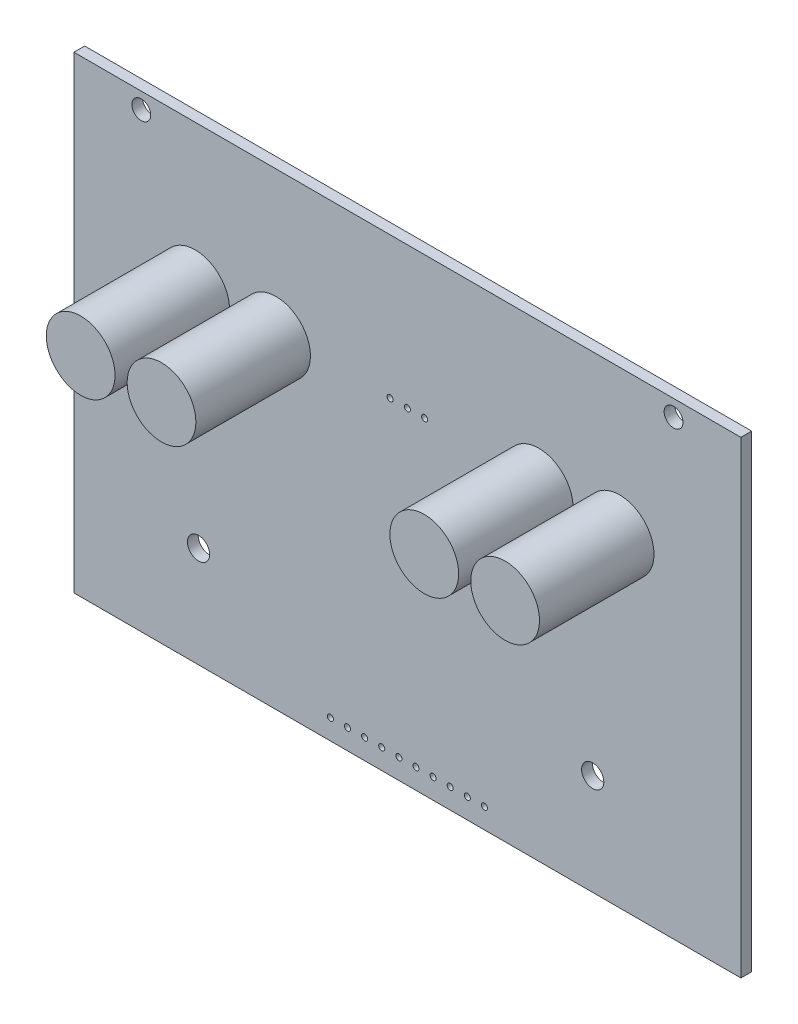
ISO-10303-21;
HEADER;
FILE_DESCRIPTION(('STEP AP214'),'2;1');
FILE_NAME('part.step','',(''),(''),'','','');
FILE_SCHEMA(('AUTOMOTIVE_DESIGN { 1 0 10303 214 1 1 1 1 }'));
ENDSEC;
DATA;
#1=APPLICATION_CONTEXT('core data for automotive mechanical design processes');
#2=APPLICATION_PROTOCOL_DEFINITION('international standard','automotive_design',2000,#1);
#3=PRODUCT_CONTEXT('',#1,'mechanical');
#4=PRODUCT('Part','Part','',(#3));
#5=PRODUCT_RELATED_PRODUCT_CATEGORY('part','',(#4));
#6=PRODUCT_DEFINITION_FORMATION('','',#4);
#7=PRODUCT_DEFINITION_CONTEXT('part definition',#1,'design');
#8=PRODUCT_DEFINITION('design','',#6,#7);
#9=PRODUCT_DEFINITION_SHAPE('','',#8);
#10=(LENGTH_UNIT() NAMED_UNIT(*) SI_UNIT(.MILLI.,.METRE.));
#11=(NAMED_UNIT(*) PLANE_ANGLE_UNIT() SI_UNIT($,.RADIAN.));
#12=(NAMED_UNIT(*) SI_UNIT($,.STERADIAN.) SOLID_ANGLE_UNIT());
#13=UNCERTAINTY_MEASURE_WITH_UNIT(LENGTH_MEASURE(1.E-05),#10,'distance_accuracy_value','');
#14=(GEOMETRIC_REPRESENTATION_CONTEXT(3) GLOBAL_UNCERTAINTY_ASSIGNED_CONTEXT((#13)) GLOBAL_UNIT_ASSIGNED_CONTEXT((#10,
#11,#12)) REPRESENTATION_CONTEXT('',''));
#15=CARTESIAN_POINT('',(0.,0.,0.));
#16=DIRECTION('',(0.,0.,1.));
#17=DIRECTION('',(1.,0.,0.));
#18=AXIS2_PLACEMENT_3D('',#15,#16,#17);
#19=CARTESIAN_POINT('',(0.,0.,1.6));
#20=DIRECTION('',(1.,0.,0.));
#21=DIRECTION('',(0.,1.,0.));
#22=AXIS2_PLACEMENT_3D('',#19,#20,#21);
#23=PLANE('',#22);
#24=DIRECTION('',(0.,-1.,0.));
#25=VECTOR('',#24,1.);
#26=CARTESIAN_POINT('',(0.,0.,0.));
#27=LINE('',#26,#25);
#28=CARTESIAN_POINT('',(0.,69.5,0.));
#29=VERTEX_POINT('',#28);
#30=CARTESIAN_POINT('',(0.,0.,0.));
#31=VERTEX_POINT('',#30);
#32=EDGE_CURVE('E103',#29,#31,#27,.T.);
#33=ORIENTED_EDGE('',*,*,#32,.T.);
#34=DIRECTION('',(0.,0.,-1.));
#35=VECTOR('',#34,1.);
#36=CARTESIAN_POINT('',(0.,0.,1.6));
#37=LINE('',#36,#35);
#38=CARTESIAN_POINT('',(0.,0.,1.6));
#39=VERTEX_POINT('',#38);
#40=EDGE_CURVE('E94',#39,#31,#37,.T.);
#41=ORIENTED_EDGE('',*,*,#40,.F.);
#42=DIRECTION('',(0.,-1.,0.));
#43=VECTOR('',#42,1.);
#44=CARTESIAN_POINT('',(0.,0.,1.6));
#45=LINE('',#44,#43);
#46=CARTESIAN_POINT('',(0.,69.5,1.6));
#47=VERTEX_POINT('',#46);
#48=EDGE_CURVE('E88',#47,#39,#45,.T.);
#49=ORIENTED_EDGE('',*,*,#48,.F.);
#50=DIRECTION('',(0.,0.,-1.));
#51=VECTOR('',#50,1.);
#52=CARTESIAN_POINT('',(0.,69.5,1.6));
#53=LINE('',#52,#51);
#54=EDGE_CURVE('E99',#47,#29,#53,.T.);
#55=ORIENTED_EDGE('',*,*,#54,.T.);
#56=EDGE_LOOP('',(#33,#41,#49,#55));
#57=FACE_BOUND('',#56,.T.);
#58=ADVANCED_FACE('F36',(#57),#23,.F.);
#59=CARTESIAN_POINT('',(0.,0.,1.6));
#60=DIRECTION('',(0.,1.,0.));
#61=DIRECTION('',(0.,0.,1.));
#62=AXIS2_PLACEMENT_3D('',#59,#60,#61);
#63=PLANE('',#62);
#64=DIRECTION('',(1.,0.,0.));
#65=VECTOR('',#64,1.);
#66=CARTESIAN_POINT('',(0.,0.,0.));
#67=LINE('',#66,#65);
#68=CARTESIAN_POINT('',(99.,0.,0.));
#69=VERTEX_POINT('',#68);
#70=EDGE_CURVE('E93',#31,#69,#67,.T.);
#71=ORIENTED_EDGE('',*,*,#70,.T.);
#72=DIRECTION('',(0.,0.,-1.));
#73=VECTOR('',#72,1.);
#74=CARTESIAN_POINT('',(99.,0.,1.6));
#75=LINE('',#74,#73);
#76=CARTESIAN_POINT('',(99.,0.,1.6));
#77=VERTEX_POINT('',#76);
#78=EDGE_CURVE('E91',#77,#69,#75,.T.);
#79=ORIENTED_EDGE('',*,*,#78,.F.);
#80=DIRECTION('',(1.,0.,0.));
#81=VECTOR('',#80,1.);
#82=CARTESIAN_POINT('',(0.,0.,1.6));
#83=LINE('',#82,#81);
#84=EDGE_CURVE('E83',#39,#77,#83,.T.);
#85=ORIENTED_EDGE('',*,*,#84,.F.);
#86=ORIENTED_EDGE('',*,*,#40,.T.);
#87=EDGE_LOOP('',(#71,#79,#85,#86));
#88=FACE_BOUND('',#87,.T.);
#89=ADVANCED_FACE('F92',(#88),#63,.F.);
#90=CARTESIAN_POINT('',(99.,0.,1.6));
#91=DIRECTION('',(-1.,0.,0.));
#92=DIRECTION('',(0.,-1.,0.));
#93=AXIS2_PLACEMENT_3D('',#90,#91,#92);
#94=PLANE('',#93);
#95=DIRECTION('',(0.,1.,0.));
#96=VECTOR('',#95,1.);
#97=CARTESIAN_POINT('',(99.,0.,0.));
#98=LINE('',#97,#96);
#99=CARTESIAN_POINT('',(99.,69.5,0.));
#100=VERTEX_POINT('',#99);
#101=EDGE_CURVE('E69',#69,#100,#98,.T.);
#102=ORIENTED_EDGE('',*,*,#101,.T.);
#103=DIRECTION('',(0.,0.,-1.));
#104=VECTOR('',#103,1.);
#105=CARTESIAN_POINT('',(99.,69.5,1.6));
#106=LINE('',#105,#104);
#107=CARTESIAN_POINT('',(99.,69.5,1.6));
#108=VERTEX_POINT('',#107);
#109=EDGE_CURVE('E95',#108,#100,#106,.T.);
#110=ORIENTED_EDGE('',*,*,#109,.F.);
#111=DIRECTION('',(0.,1.,0.));
#112=VECTOR('',#111,1.);
#113=CARTESIAN_POINT('',(99.,0.,1.6));
#114=LINE('',#113,#112);
#115=EDGE_CURVE('E86',#77,#108,#114,.T.);
#116=ORIENTED_EDGE('',*,*,#115,.F.);
#117=ORIENTED_EDGE('',*,*,#78,.T.);
#118=EDGE_LOOP('',(#102,#110,#116,#117));
#119=FACE_BOUND('',#118,.T.);
#120=ADVANCED_FACE('F97',(#119),#94,.F.);
#121=CARTESIAN_POINT('',(0.,69.5,1.6));
#122=DIRECTION('',(0.,-1.,0.));
#123=DIRECTION('',(0.,0.,-1.));
#124=AXIS2_PLACEMENT_3D('',#121,#122,#123);
#125=PLANE('',#124);
#126=DIRECTION('',(-1.,0.,0.));
#127=VECTOR('',#126,1.);
#128=CARTESIAN_POINT('',(0.,69.5,0.));
#129=LINE('',#128,#127);
#130=EDGE_CURVE('E75',#100,#29,#129,.T.);
#131=ORIENTED_EDGE('',*,*,#130,.T.);
#132=ORIENTED_EDGE('',*,*,#54,.F.);
#133=DIRECTION('',(-1.,0.,0.));
#134=VECTOR('',#133,1.);
#135=CARTESIAN_POINT('',(0.,69.5,1.6));
#136=LINE('',#135,#134);
#137=EDGE_CURVE('E52',#108,#47,#136,.T.);
#138=ORIENTED_EDGE('',*,*,#137,.F.);
#139=ORIENTED_EDGE('',*,*,#109,.T.);
#140=EDGE_LOOP('',(#131,#132,#138,#139));
#141=FACE_BOUND('',#140,.T.);
#142=ADVANCED_FACE('F126',(#141),#125,.F.);
#143=CARTESIAN_POINT('',(0.,0.,1.6));
#144=DIRECTION('',(0.,0.,-1.));
#145=DIRECTION('',(-1.,0.,0.));
#146=AXIS2_PLACEMENT_3D('',#143,#144,#145);
#147=PLANE('',#146);
#148=CARTESIAN_POINT('',(9.99999999999997,67.1,1.6));
#149=DIRECTION('',(0.,0.,-1.));
#150=DIRECTION('',(-1.,0.,0.));
#151=AXIS2_PLACEMENT_3D('',#148,#149,#150);
#152=CIRCLE('',#151,1.4);
#153=CARTESIAN_POINT('',(8.59999999999997,67.1,1.6));
#154=VERTEX_POINT('',#153);
#155=EDGE_CURVE('E435',#154,#154,#152,.T.);
#156=ORIENTED_EDGE('',*,*,#155,.T.);
#157=EDGE_LOOP('',(#156));
#158=FACE_BOUND('',#157,.T.);
#159=CARTESIAN_POINT('',(48.23,3.00000000000002,1.6));
#160=DIRECTION('',(0.,0.,-1.));
#161=DIRECTION('',(-1.,0.,0.));
#162=AXIS2_PLACEMENT_3D('',#159,#160,#161);
#163=CIRCLE('',#162,0.450000000000002);
#164=CARTESIAN_POINT('',(47.78,3.00000000000002,1.6));
#165=VERTEX_POINT('',#164);
#166=EDGE_CURVE('E437',#165,#165,#163,.T.);
#167=ORIENTED_EDGE('',*,*,#166,.T.);
#168=EDGE_LOOP('',(#167));
#169=FACE_BOUND('',#168,.T.);
#170=CARTESIAN_POINT('',(50.77,3.00000000000002,1.6));
#171=DIRECTION('',(0.,0.,-1.));
#172=DIRECTION('',(-1.,0.,0.));
#173=AXIS2_PLACEMENT_3D('',#170,#171,#172);
#174=CIRCLE('',#173,0.450000000000002);
#175=CARTESIAN_POINT('',(50.32,3.00000000000002,1.6));
#176=VERTEX_POINT('',#175);
#177=EDGE_CURVE('E443',#176,#176,#174,.T.);
#178=ORIENTED_EDGE('',*,*,#177,.T.);
#179=EDGE_LOOP('',(#178));
#180=FACE_BOUND('',#179,.T.);
#181=CARTESIAN_POINT('',(53.31,3.00000000000001,1.6));
#182=DIRECTION('',(0.,0.,-1.));
#183=DIRECTION('',(-1.,0.,0.));
#184=AXIS2_PLACEMENT_3D('',#181,#182,#183);
#185=CIRCLE('',#184,0.450000000000002);
#186=CARTESIAN_POINT('',(52.86,3.00000000000001,1.6));
#187=VERTEX_POINT('',#186);
#188=EDGE_CURVE('E458',#187,#187,#185,.T.);
#189=ORIENTED_EDGE('',*,*,#188,.T.);
#190=EDGE_LOOP('',(#189));
#191=FACE_BOUND('',#190,.T.);
#192=CARTESIAN_POINT('',(55.85,3.00000000000001,1.6));
#193=DIRECTION('',(0.,0.,-1.));
#194=DIRECTION('',(-1.,0.,0.));
#195=AXIS2_PLACEMENT_3D('',#192,#193,#194);
#196=CIRCLE('',#195,0.450000000000002);
#197=CARTESIAN_POINT('',(55.4,3.00000000000001,1.6));
#198=VERTEX_POINT('',#197);
#199=EDGE_CURVE('E461',#198,#198,#196,.T.);
#200=ORIENTED_EDGE('',*,*,#199,.T.);
#201=EDGE_LOOP('',(#200));
#202=FACE_BOUND('',#201,.T.);
#203=CARTESIAN_POINT('',(58.39,3.00000000000001,1.6));
#204=DIRECTION('',(0.,0.,-1.));
#205=DIRECTION('',(-1.,0.,0.));
#206=AXIS2_PLACEMENT_3D('',#203,#204,#205);
#207=CIRCLE('',#206,0.450000000000002);
#208=CARTESIAN_POINT('',(57.94,3.00000000000001,1.6));
#209=VERTEX_POINT('',#208);
#210=EDGE_CURVE('E464',#209,#209,#207,.T.);
#211=ORIENTED_EDGE('',*,*,#210,.T.);
#212=EDGE_LOOP('',(#211));
#213=FACE_BOUND('',#212,.T.);
#214=CARTESIAN_POINT('',(60.93,3.00000000000001,1.6));
#215=DIRECTION('',(0.,0.,-1.));
#216=DIRECTION('',(-1.,0.,0.));
#217=AXIS2_PLACEMENT_3D('',#214,#215,#216);
#218=CIRCLE('',#217,0.450000000000002);
#219=CARTESIAN_POINT('',(60.48,3.00000000000001,1.6));
#220=VERTEX_POINT('',#219);
#221=EDGE_CURVE('E467',#220,#220,#218,.T.);
#222=ORIENTED_EDGE('',*,*,#221,.T.);
#223=EDGE_LOOP('',(#222));
#224=FACE_BOUND('',#223,.T.);
#225=CARTESIAN_POINT('',(40.61,3.00000000000001,1.6));
#226=DIRECTION('',(0.,0.,-1.));
#227=DIRECTION('',(-1.,0.,0.));
#228=AXIS2_PLACEMENT_3D('',#225,#226,#227);
#229=CIRCLE('',#228,0.450000000000002);
#230=CARTESIAN_POINT('',(40.16,3.00000000000001,1.6));
#231=VERTEX_POINT('',#230);
#232=EDGE_CURVE('E470',#231,#231,#229,.T.);
#233=ORIENTED_EDGE('',*,*,#232,.T.);
#234=EDGE_LOOP('',(#233));
#235=FACE_BOUND('',#234,.T.);
#236=CARTESIAN_POINT('',(38.07,3.00000000000001,1.6));
#237=DIRECTION('',(0.,0.,-1.));
#238=DIRECTION('',(-1.,0.,0.));
#239=AXIS2_PLACEMENT_3D('',#236,#237,#238);
#240=CIRCLE('',#239,0.450000000000002);
#241=CARTESIAN_POINT('',(37.62,3.00000000000001,1.6));
#242=VERTEX_POINT('',#241);
#243=EDGE_CURVE('E473',#242,#242,#240,.T.);
#244=ORIENTED_EDGE('',*,*,#243,.T.);
#245=EDGE_LOOP('',(#244));
#246=FACE_BOUND('',#245,.T.);
#247=CARTESIAN_POINT('',(49.5,48.5,1.6));
#248=DIRECTION('',(0.,0.,-1.));
#249=DIRECTION('',(-1.,0.,0.));
#250=AXIS2_PLACEMENT_3D('',#247,#248,#249);
#251=CIRCLE('',#250,0.450000000000002);
#252=CARTESIAN_POINT('',(49.05,48.5,1.6));
#253=VERTEX_POINT('',#252);
#254=EDGE_CURVE('E476',#253,#253,#251,.T.);
#255=ORIENTED_EDGE('',*,*,#254,.T.);
#256=EDGE_LOOP('',(#255));
#257=FACE_BOUND('',#256,.T.);
#258=CARTESIAN_POINT('',(77.,15.,1.6));
#259=DIRECTION('',(0.,0.,-1.));
#260=DIRECTION('',(-1.,0.,0.));
#261=AXIS2_PLACEMENT_3D('',#258,#259,#260);
#262=CIRCLE('',#261,1.65);
#263=CARTESIAN_POINT('',(75.35,15.,1.6));
#264=VERTEX_POINT('',#263);
#265=EDGE_CURVE('E479',#264,#264,#262,.T.);
#266=ORIENTED_EDGE('',*,*,#265,.T.);
#267=EDGE_LOOP('',(#266));
#268=FACE_BOUND('',#267,.T.);
#269=CARTESIAN_POINT('',(18.5,15.,1.6));
#270=DIRECTION('',(0.,0.,-1.));
#271=DIRECTION('',(-1.,0.,0.));
#272=AXIS2_PLACEMENT_3D('',#269,#270,#271);
#273=CIRCLE('',#272,1.65);
#274=CARTESIAN_POINT('',(16.85,15.,1.6));
#275=VERTEX_POINT('',#274);
#276=EDGE_CURVE('E482',#275,#275,#273,.T.);
#277=ORIENTED_EDGE('',*,*,#276,.T.);
#278=EDGE_LOOP('',(#277));
#279=FACE_BOUND('',#278,.T.);
#280=CARTESIAN_POINT('',(89.,67.1,1.6));
#281=DIRECTION('',(0.,0.,-1.));
#282=DIRECTION('',(-1.,0.,0.));
#283=AXIS2_PLACEMENT_3D('',#280,#281,#282);
#284=CIRCLE('',#283,1.4);
#285=CARTESIAN_POINT('',(87.6,67.1,1.6));
#286=VERTEX_POINT('',#285);
#287=EDGE_CURVE('E485',#286,#286,#284,.T.);
#288=ORIENTED_EDGE('',*,*,#287,.T.);
#289=EDGE_LOOP('',(#288));
#290=FACE_BOUND('',#289,.T.);
#291=CARTESIAN_POINT('',(52.06,48.5,1.6));
#292=DIRECTION('',(0.,0.,-1.));
#293=DIRECTION('',(-1.,0.,0.));
#294=AXIS2_PLACEMENT_3D('',#291,#292,#293);
#295=CIRCLE('',#294,0.450000000000002);
#296=CARTESIAN_POINT('',(51.61,48.5,1.6));
#297=VERTEX_POINT('',#296);
#298=EDGE_CURVE('E488',#297,#297,#295,.T.);
#299=ORIENTED_EDGE('',*,*,#298,.T.);
#300=EDGE_LOOP('',(#299));
#301=FACE_BOUND('',#300,.T.);
#302=CARTESIAN_POINT('',(46.94,48.5,1.6));
#303=DIRECTION('',(0.,0.,-1.));
#304=DIRECTION('',(-1.,0.,0.));
#305=AXIS2_PLACEMENT_3D('',#302,#303,#304);
#306=CIRCLE('',#305,0.450000000000002);
#307=CARTESIAN_POINT('',(46.49,48.5,1.6));
#308=VERTEX_POINT('',#307);
#309=EDGE_CURVE('E491',#308,#308,#306,.T.);
#310=ORIENTED_EDGE('',*,*,#309,.T.);
#311=EDGE_LOOP('',(#310));
#312=FACE_BOUND('',#311,.T.);
#313=CARTESIAN_POINT('',(43.15,3.00000000000001,1.6));
#314=DIRECTION('',(0.,0.,-1.));
#315=DIRECTION('',(-1.,0.,0.));
#316=AXIS2_PLACEMENT_3D('',#313,#314,#315);
#317=CIRCLE('',#316,0.450000000000002);
#318=CARTESIAN_POINT('',(42.7,3.00000000000001,1.6));
#319=VERTEX_POINT('',#318);
#320=EDGE_CURVE('E494',#319,#319,#317,.T.);
#321=ORIENTED_EDGE('',*,*,#320,.T.);
#322=EDGE_LOOP('',(#321));
#323=FACE_BOUND('',#322,.T.);
#324=CARTESIAN_POINT('',(45.69,3.00000000000001,1.6));
#325=DIRECTION('',(0.,0.,-1.));
#326=DIRECTION('',(-1.,0.,0.));
#327=AXIS2_PLACEMENT_3D('',#324,#325,#326);
#328=CIRCLE('',#327,0.450000000000002);
#329=CARTESIAN_POINT('',(45.24,3.00000000000001,1.6));
#330=VERTEX_POINT('',#329);
#331=EDGE_CURVE('E497',#330,#330,#328,.T.);
#332=ORIENTED_EDGE('',*,*,#331,.T.);
#333=EDGE_LOOP('',(#332));
#334=FACE_BOUND('',#333,.T.);
#335=CARTESIAN_POINT('',(81.,48.,1.6));
#336=DIRECTION('',(0.,0.,-1.));
#337=DIRECTION('',(-1.,0.,0.));
#338=AXIS2_PLACEMENT_3D('',#335,#336,#337);
#339=CIRCLE('',#338,5.1);
#340=CARTESIAN_POINT('',(75.9,48.,1.6));
#341=VERTEX_POINT('',#340);
#342=EDGE_CURVE('E11',#341,#341,#339,.F.);
#343=ORIENTED_EDGE('',*,*,#342,.F.);
#344=EDGE_LOOP('',(#343));
#345=FACE_BOUND('',#344,.T.);
#346=CARTESIAN_POINT('',(69.,48.,1.6));
#347=DIRECTION('',(0.,0.,-1.));
#348=DIRECTION('',(-1.,0.,0.));
#349=AXIS2_PLACEMENT_3D('',#346,#347,#348);
#350=CIRCLE('',#349,5.1);
#351=CARTESIAN_POINT('',(63.9,48.,1.6));
#352=VERTEX_POINT('',#351);
#353=EDGE_CURVE('E44',#352,#352,#350,.F.);
#354=ORIENTED_EDGE('',*,*,#353,.F.);
#355=EDGE_LOOP('',(#354));
#356=FACE_BOUND('',#355,.T.);
#357=CARTESIAN_POINT('',(30.,48.,1.6));
#358=DIRECTION('',(0.,0.,-1.));
#359=DIRECTION('',(-1.,0.,0.));
#360=AXIS2_PLACEMENT_3D('',#357,#358,#359);
#361=CIRCLE('',#360,5.1);
#362=CARTESIAN_POINT('',(24.9,48.,1.6));
#363=VERTEX_POINT('',#362);
#364=EDGE_CURVE('E116',#363,#363,#361,.F.);
#365=ORIENTED_EDGE('',*,*,#364,.F.);
#366=EDGE_LOOP('',(#365));
#367=FACE_BOUND('',#366,.T.);
#368=CARTESIAN_POINT('',(18.,48.,1.6));
#369=DIRECTION('',(0.,0.,-1.));
#370=DIRECTION('',(-1.,0.,0.));
#371=AXIS2_PLACEMENT_3D('',#368,#369,#370);
#372=CIRCLE('',#371,5.1);
#373=CARTESIAN_POINT('',(12.9,48.,1.6));
#374=VERTEX_POINT('',#373);
#375=EDGE_CURVE('E113',#374,#374,#372,.F.);
#376=ORIENTED_EDGE('',*,*,#375,.F.);
#377=EDGE_LOOP('',(#376));
#378=FACE_BOUND('',#377,.T.);
#379=ORIENTED_EDGE('',*,*,#48,.T.);
#380=ORIENTED_EDGE('',*,*,#84,.T.);
#381=ORIENTED_EDGE('',*,*,#115,.T.);
#382=ORIENTED_EDGE('',*,*,#137,.T.);
#383=EDGE_LOOP('',(#379,#380,#381,#382));
#384=FACE_BOUND('',#383,.T.);
#385=ADVANCED_FACE('F84',(#158,#169,#180,#191,#202,#213,#224,#235,#246,#257,#268,#279,#290,#301,
#312,#323,#334,#345,#356,#367,#378,#384),#147,.F.);
#386=CARTESIAN_POINT('',(0.,0.,0.));
#387=DIRECTION('',(0.,0.,-1.));
#388=DIRECTION('',(-1.,0.,0.));
#389=AXIS2_PLACEMENT_3D('',#386,#387,#388);
#390=PLANE('',#389);
#391=CARTESIAN_POINT('',(9.99999999999997,67.1,0.));
#392=DIRECTION('',(0.,0.,1.));
#393=DIRECTION('',(1.,0.,0.));
#394=AXIS2_PLACEMENT_3D('',#391,#392,#393);
#395=CIRCLE('',#394,1.4);
#396=CARTESIAN_POINT('',(11.4,67.1,0.));
#397=VERTEX_POINT('',#396);
#398=EDGE_CURVE('E432',#397,#397,#395,.T.);
#399=ORIENTED_EDGE('',*,*,#398,.T.);
#400=EDGE_LOOP('',(#399));
#401=FACE_BOUND('',#400,.T.);
#402=CARTESIAN_POINT('',(48.23,3.00000000000002,0.));
#403=DIRECTION('',(0.,0.,1.));
#404=DIRECTION('',(1.,0.,0.));
#405=AXIS2_PLACEMENT_3D('',#402,#403,#404);
#406=CIRCLE('',#405,0.450000000000002);
#407=CARTESIAN_POINT('',(48.68,3.00000000000002,0.));
#408=VERTEX_POINT('',#407);
#409=EDGE_CURVE('E517',#408,#408,#406,.T.);
#410=ORIENTED_EDGE('',*,*,#409,.T.);
#411=EDGE_LOOP('',(#410));
#412=FACE_BOUND('',#411,.T.);
#413=CARTESIAN_POINT('',(50.77,3.00000000000002,0.));
#414=DIRECTION('',(0.,0.,1.));
#415=DIRECTION('',(1.,0.,0.));
#416=AXIS2_PLACEMENT_3D('',#413,#414,#415);
#417=CIRCLE('',#416,0.450000000000002);
#418=CARTESIAN_POINT('',(51.22,3.00000000000002,0.));
#419=VERTEX_POINT('',#418);
#420=EDGE_CURVE('E532',#419,#419,#417,.T.);
#421=ORIENTED_EDGE('',*,*,#420,.T.);
#422=EDGE_LOOP('',(#421));
#423=FACE_BOUND('',#422,.T.);
#424=CARTESIAN_POINT('',(53.31,3.00000000000001,0.));
#425=DIRECTION('',(0.,0.,1.));
#426=DIRECTION('',(1.,0.,0.));
#427=AXIS2_PLACEMENT_3D('',#424,#425,#426);
#428=CIRCLE('',#427,0.450000000000002);
#429=CARTESIAN_POINT('',(53.76,3.00000000000001,0.));
#430=VERTEX_POINT('',#429);
#431=EDGE_CURVE('E528',#430,#430,#428,.T.);
#432=ORIENTED_EDGE('',*,*,#431,.T.);
#433=EDGE_LOOP('',(#432));
#434=FACE_BOUND('',#433,.T.);
#435=CARTESIAN_POINT('',(55.85,3.00000000000001,0.));
#436=DIRECTION('',(0.,0.,1.));
#437=DIRECTION('',(1.,0.,0.));
#438=AXIS2_PLACEMENT_3D('',#435,#436,#437);
#439=CIRCLE('',#438,0.450000000000002);
#440=CARTESIAN_POINT('',(56.3,3.00000000000001,0.));
#441=VERTEX_POINT('',#440);
#442=EDGE_CURVE('E525',#441,#441,#439,.T.);
#443=ORIENTED_EDGE('',*,*,#442,.T.);
#444=EDGE_LOOP('',(#443));
#445=FACE_BOUND('',#444,.T.);
#446=CARTESIAN_POINT('',(58.39,3.00000000000001,0.));
#447=DIRECTION('',(0.,0.,1.));
#448=DIRECTION('',(1.,0.,0.));
#449=AXIS2_PLACEMENT_3D('',#446,#447,#448);
#450=CIRCLE('',#449,0.450000000000002);
#451=CARTESIAN_POINT('',(58.84,3.00000000000001,0.));
#452=VERTEX_POINT('',#451);
#453=EDGE_CURVE('E529',#452,#452,#450,.T.);
#454=ORIENTED_EDGE('',*,*,#453,.T.);
#455=EDGE_LOOP('',(#454));
#456=FACE_BOUND('',#455,.T.);
#457=CARTESIAN_POINT('',(60.93,3.00000000000001,0.));
#458=DIRECTION('',(0.,0.,1.));
#459=DIRECTION('',(1.,0.,0.));
#460=AXIS2_PLACEMENT_3D('',#457,#458,#459);
#461=CIRCLE('',#460,0.450000000000002);
#462=CARTESIAN_POINT('',(61.38,3.00000000000001,0.));
#463=VERTEX_POINT('',#462);
#464=EDGE_CURVE('E543',#463,#463,#461,.T.);
#465=ORIENTED_EDGE('',*,*,#464,.T.);
#466=EDGE_LOOP('',(#465));
#467=FACE_BOUND('',#466,.T.);
#468=CARTESIAN_POINT('',(40.61,3.00000000000001,0.));
#469=DIRECTION('',(0.,0.,1.));
#470=DIRECTION('',(1.,0.,0.));
#471=AXIS2_PLACEMENT_3D('',#468,#469,#470);
#472=CIRCLE('',#471,0.450000000000002);
#473=CARTESIAN_POINT('',(41.06,3.00000000000001,0.));
#474=VERTEX_POINT('',#473);
#475=EDGE_CURVE('E540',#474,#474,#472,.T.);
#476=ORIENTED_EDGE('',*,*,#475,.T.);
#477=EDGE_LOOP('',(#476));
#478=FACE_BOUND('',#477,.T.);
#479=CARTESIAN_POINT('',(38.07,3.00000000000001,0.));
#480=DIRECTION('',(0.,0.,1.));
#481=DIRECTION('',(1.,0.,0.));
#482=AXIS2_PLACEMENT_3D('',#479,#480,#481);
#483=CIRCLE('',#482,0.450000000000002);
#484=CARTESIAN_POINT('',(38.52,3.00000000000001,0.));
#485=VERTEX_POINT('',#484);
#486=EDGE_CURVE('E537',#485,#485,#483,.T.);
#487=ORIENTED_EDGE('',*,*,#486,.T.);
#488=EDGE_LOOP('',(#487));
#489=FACE_BOUND('',#488,.T.);
#490=CARTESIAN_POINT('',(49.5,48.5,0.));
#491=DIRECTION('',(0.,0.,1.));
#492=DIRECTION('',(1.,0.,0.));
#493=AXIS2_PLACEMENT_3D('',#490,#491,#492);
#494=CIRCLE('',#493,0.450000000000002);
#495=CARTESIAN_POINT('',(49.95,48.5,0.));
#496=VERTEX_POINT('',#495);
#497=EDGE_CURVE('E507',#496,#496,#494,.T.);
#498=ORIENTED_EDGE('',*,*,#497,.T.);
#499=EDGE_LOOP('',(#498));
#500=FACE_BOUND('',#499,.T.);
#501=CARTESIAN_POINT('',(77.,15.,0.));
#502=DIRECTION('',(0.,0.,1.));
#503=DIRECTION('',(1.,0.,0.));
#504=AXIS2_PLACEMENT_3D('',#501,#502,#503);
#505=CIRCLE('',#504,1.65);
#506=CARTESIAN_POINT('',(78.65,15.,0.));
#507=VERTEX_POINT('',#506);
#508=EDGE_CURVE('E504',#507,#507,#505,.T.);
#509=ORIENTED_EDGE('',*,*,#508,.T.);
#510=EDGE_LOOP('',(#509));
#511=FACE_BOUND('',#510,.T.);
#512=CARTESIAN_POINT('',(18.5,15.,0.));
#513=DIRECTION('',(0.,0.,1.));
#514=DIRECTION('',(1.,0.,0.));
#515=AXIS2_PLACEMENT_3D('',#512,#513,#514);
#516=CIRCLE('',#515,1.65);
#517=CARTESIAN_POINT('',(20.15,15.,0.));
#518=VERTEX_POINT('',#517);
#519=EDGE_CURVE('E500',#518,#518,#516,.T.);
#520=ORIENTED_EDGE('',*,*,#519,.T.);
#521=EDGE_LOOP('',(#520));
#522=FACE_BOUND('',#521,.T.);
#523=CARTESIAN_POINT('',(89.,67.1,0.));
#524=DIRECTION('',(0.,0.,1.));
#525=DIRECTION('',(1.,0.,0.));
#526=AXIS2_PLACEMENT_3D('',#523,#524,#525);
#527=CIRCLE('',#526,1.4);
#528=CARTESIAN_POINT('',(90.4,67.1,0.));
#529=VERTEX_POINT('',#528);
#530=EDGE_CURVE('E503',#529,#529,#527,.T.);
#531=ORIENTED_EDGE('',*,*,#530,.T.);
#532=EDGE_LOOP('',(#531));
#533=FACE_BOUND('',#532,.T.);
#534=CARTESIAN_POINT('',(52.06,48.5,0.));
#535=DIRECTION('',(0.,0.,1.));
#536=DIRECTION('',(1.,0.,0.));
#537=AXIS2_PLACEMENT_3D('',#534,#535,#536);
#538=CIRCLE('',#537,0.450000000000002);
#539=CARTESIAN_POINT('',(52.51,48.5,0.));
#540=VERTEX_POINT('',#539);
#541=EDGE_CURVE('E510',#540,#540,#538,.T.);
#542=ORIENTED_EDGE('',*,*,#541,.T.);
#543=EDGE_LOOP('',(#542));
#544=FACE_BOUND('',#543,.T.);
#545=CARTESIAN_POINT('',(46.94,48.5,0.));
#546=DIRECTION('',(0.,0.,1.));
#547=DIRECTION('',(1.,0.,0.));
#548=AXIS2_PLACEMENT_3D('',#545,#546,#547);
#549=CIRCLE('',#548,0.450000000000002);
#550=CARTESIAN_POINT('',(47.39,48.5,0.));
#551=VERTEX_POINT('',#550);
#552=EDGE_CURVE('E520',#551,#551,#549,.T.);
#553=ORIENTED_EDGE('',*,*,#552,.T.);
#554=EDGE_LOOP('',(#553));
#555=FACE_BOUND('',#554,.T.);
#556=CARTESIAN_POINT('',(43.15,3.00000000000001,0.));
#557=DIRECTION('',(0.,0.,1.));
#558=DIRECTION('',(1.,0.,0.));
#559=AXIS2_PLACEMENT_3D('',#556,#557,#558);
#560=CIRCLE('',#559,0.450000000000002);
#561=CARTESIAN_POINT('',(43.6,3.00000000000001,0.));
#562=VERTEX_POINT('',#561);
#563=EDGE_CURVE('E516',#562,#562,#560,.T.);
#564=ORIENTED_EDGE('',*,*,#563,.T.);
#565=EDGE_LOOP('',(#564));
#566=FACE_BOUND('',#565,.T.);
#567=CARTESIAN_POINT('',(45.69,3.00000000000001,0.));
#568=DIRECTION('',(0.,0.,1.));
#569=DIRECTION('',(1.,0.,0.));
#570=AXIS2_PLACEMENT_3D('',#567,#568,#569);
#571=CIRCLE('',#570,0.450000000000002);
#572=CARTESIAN_POINT('',(46.14,3.00000000000001,0.));
#573=VERTEX_POINT('',#572);
#574=EDGE_CURVE('E513',#573,#573,#571,.T.);
#575=ORIENTED_EDGE('',*,*,#574,.T.);
#576=EDGE_LOOP('',(#575));
#577=FACE_BOUND('',#576,.T.);
#578=ORIENTED_EDGE('',*,*,#32,.F.);
#579=ORIENTED_EDGE('',*,*,#130,.F.);
#580=ORIENTED_EDGE('',*,*,#101,.F.);
#581=ORIENTED_EDGE('',*,*,#70,.F.);
#582=EDGE_LOOP('',(#578,#579,#580,#581));
#583=FACE_BOUND('',#582,.T.);
#584=ADVANCED_FACE('F125',(#401,#412,#423,#434,#445,#456,#467,#478,#489,#500,#511,#522,#533,
#544,#555,#566,#577,#583),#390,.T.);
#585=CARTESIAN_POINT('',(18.,48.,18.6));
#586=DIRECTION('',(0.,0.,-1.));
#587=DIRECTION('',(-1.,0.,0.));
#588=AXIS2_PLACEMENT_3D('',#585,#586,#587);
#589=CYLINDRICAL_SURFACE('',#588,5.1);
#590=CARTESIAN_POINT('',(18.,48.,18.6));
#591=DIRECTION('',(0.,0.,1.));
#592=DIRECTION('',(1.,0.,0.));
#593=AXIS2_PLACEMENT_3D('',#590,#591,#592);
#594=CIRCLE('',#593,5.1);
#595=CARTESIAN_POINT('',(23.1,48.,18.6));
#596=VERTEX_POINT('',#595);
#597=EDGE_CURVE('E106',#596,#596,#594,.T.);
#598=ORIENTED_EDGE('',*,*,#597,.F.);
#599=EDGE_LOOP('',(#598));
#600=FACE_BOUND('',#599,.T.);
#601=ORIENTED_EDGE('',*,*,#375,.T.);
#602=EDGE_LOOP('',(#601));
#603=FACE_BOUND('',#602,.T.);
#604=ADVANCED_FACE('F133',(#600,#603),#589,.T.);
#605=CARTESIAN_POINT('',(18.,48.,18.6));
#606=DIRECTION('',(0.,0.,1.));
#607=DIRECTION('',(1.,0.,0.));
#608=AXIS2_PLACEMENT_3D('',#605,#606,#607);
#609=PLANE('',#608);
#610=ORIENTED_EDGE('',*,*,#597,.T.);
#611=EDGE_LOOP('',(#610));
#612=FACE_BOUND('',#611,.T.);
#613=ADVANCED_FACE('F135',(#612),#609,.T.);
#614=CARTESIAN_POINT('',(30.,48.,18.6));
#615=DIRECTION('',(0.,0.,-1.));
#616=DIRECTION('',(-1.,0.,0.));
#617=AXIS2_PLACEMENT_3D('',#614,#615,#616);
#618=CYLINDRICAL_SURFACE('',#617,5.1);
#619=CARTESIAN_POINT('',(30.,48.,18.6));
#620=DIRECTION('',(0.,0.,1.));
#621=DIRECTION('',(1.,0.,0.));
#622=AXIS2_PLACEMENT_3D('',#619,#620,#621);
#623=CIRCLE('',#622,5.1);
#624=CARTESIAN_POINT('',(35.1,48.,18.6));
#625=VERTEX_POINT('',#624);
#626=EDGE_CURVE('E449',#625,#625,#623,.T.);
#627=ORIENTED_EDGE('',*,*,#626,.F.);
#628=EDGE_LOOP('',(#627));
#629=FACE_BOUND('',#628,.T.);
#630=ORIENTED_EDGE('',*,*,#364,.T.);
#631=EDGE_LOOP('',(#630));
#632=FACE_BOUND('',#631,.T.);
#633=ADVANCED_FACE('F142',(#629,#632),#618,.T.);
#634=CARTESIAN_POINT('',(30.,48.,18.6));
#635=DIRECTION('',(0.,0.,1.));
#636=DIRECTION('',(1.,0.,0.));
#637=AXIS2_PLACEMENT_3D('',#634,#635,#636);
#638=PLANE('',#637);
#639=ORIENTED_EDGE('',*,*,#626,.T.);
#640=EDGE_LOOP('',(#639));
#641=FACE_BOUND('',#640,.T.);
#642=ADVANCED_FACE('F208',(#641),#638,.T.);
#643=CARTESIAN_POINT('',(69.,48.,18.6));
#644=DIRECTION('',(0.,0.,-1.));
#645=DIRECTION('',(-1.,0.,0.));
#646=AXIS2_PLACEMENT_3D('',#643,#644,#645);
#647=CYLINDRICAL_SURFACE('',#646,5.1);
#648=CARTESIAN_POINT('',(69.,48.,18.6));
#649=DIRECTION('',(0.,0.,1.));
#650=DIRECTION('',(1.,0.,0.));
#651=AXIS2_PLACEMENT_3D('',#648,#649,#650);
#652=CIRCLE('',#651,5.1);
#653=CARTESIAN_POINT('',(74.1,48.,18.6));
#654=VERTEX_POINT('',#653);
#655=EDGE_CURVE('E440',#654,#654,#652,.T.);
#656=ORIENTED_EDGE('',*,*,#655,.F.);
#657=EDGE_LOOP('',(#656));
#658=FACE_BOUND('',#657,.T.);
#659=ORIENTED_EDGE('',*,*,#353,.T.);
#660=EDGE_LOOP('',(#659));
#661=FACE_BOUND('',#660,.T.);
#662=ADVANCED_FACE('F121',(#658,#661),#647,.T.);
#663=CARTESIAN_POINT('',(69.,48.,18.6));
#664=DIRECTION('',(0.,0.,1.));
#665=DIRECTION('',(1.,0.,0.));
#666=AXIS2_PLACEMENT_3D('',#663,#664,#665);
#667=PLANE('',#666);
#668=ORIENTED_EDGE('',*,*,#655,.T.);
#669=EDGE_LOOP('',(#668));
#670=FACE_BOUND('',#669,.T.);
#671=ADVANCED_FACE('F225',(#670),#667,.T.);
#672=CARTESIAN_POINT('',(81.,48.,18.6));
#673=DIRECTION('',(0.,0.,-1.));
#674=DIRECTION('',(-1.,0.,0.));
#675=AXIS2_PLACEMENT_3D('',#672,#673,#674);
#676=CYLINDRICAL_SURFACE('',#675,5.1);
#677=CARTESIAN_POINT('',(81.,48.,18.6));
#678=DIRECTION('',(0.,0.,1.));
#679=DIRECTION('',(1.,0.,0.));
#680=AXIS2_PLACEMENT_3D('',#677,#678,#679);
#681=CIRCLE('',#680,5.1);
#682=CARTESIAN_POINT('',(86.1,48.,18.6));
#683=VERTEX_POINT('',#682);
#684=EDGE_CURVE('E436',#683,#683,#681,.T.);
#685=ORIENTED_EDGE('',*,*,#684,.F.);
#686=EDGE_LOOP('',(#685));
#687=FACE_BOUND('',#686,.T.);
#688=ORIENTED_EDGE('',*,*,#342,.T.);
#689=EDGE_LOOP('',(#688));
#690=FACE_BOUND('',#689,.T.);
#691=ADVANCED_FACE('F234',(#687,#690),#676,.T.);
#692=CARTESIAN_POINT('',(81.,48.,18.6));
#693=DIRECTION('',(0.,0.,1.));
#694=DIRECTION('',(1.,0.,0.));
#695=AXIS2_PLACEMENT_3D('',#692,#693,#694);
#696=PLANE('',#695);
#697=ORIENTED_EDGE('',*,*,#684,.T.);
#698=EDGE_LOOP('',(#697));
#699=FACE_BOUND('',#698,.T.);
#700=ADVANCED_FACE('F243',(#699),#696,.T.);
#701=CARTESIAN_POINT('',(45.69,3.00000000000001,0.));
#702=DIRECTION('',(0.,0.,1.));
#703=DIRECTION('',(1.,0.,0.));
#704=AXIS2_PLACEMENT_3D('',#701,#702,#703);
#705=CYLINDRICAL_SURFACE('',#704,0.450000000000002);
#706=ORIENTED_EDGE('',*,*,#574,.F.);
#707=EDGE_LOOP('',(#706));
#708=FACE_BOUND('',#707,.T.);
#709=ORIENTED_EDGE('',*,*,#331,.F.);
#710=EDGE_LOOP('',(#709));
#711=FACE_BOUND('',#710,.T.);
#712=ADVANCED_FACE('F251',(#708,#711),#705,.F.);
#713=CARTESIAN_POINT('',(43.15,3.00000000000001,0.));
#714=DIRECTION('',(0.,0.,1.));
#715=DIRECTION('',(1.,0.,0.));
#716=AXIS2_PLACEMENT_3D('',#713,#714,#715);
#717=CYLINDRICAL_SURFACE('',#716,0.450000000000002);
#718=ORIENTED_EDGE('',*,*,#563,.F.);
#719=EDGE_LOOP('',(#718));
#720=FACE_BOUND('',#719,.T.);
#721=ORIENTED_EDGE('',*,*,#320,.F.);
#722=EDGE_LOOP('',(#721));
#723=FACE_BOUND('',#722,.T.);
#724=ADVANCED_FACE('F259',(#720,#723),#717,.F.);
#725=CARTESIAN_POINT('',(46.94,48.5,0.));
#726=DIRECTION('',(0.,0.,1.));
#727=DIRECTION('',(1.,0.,0.));
#728=AXIS2_PLACEMENT_3D('',#725,#726,#727);
#729=CYLINDRICAL_SURFACE('',#728,0.450000000000002);
#730=ORIENTED_EDGE('',*,*,#552,.F.);
#731=EDGE_LOOP('',(#730));
#732=FACE_BOUND('',#731,.T.);
#733=ORIENTED_EDGE('',*,*,#309,.F.);
#734=EDGE_LOOP('',(#733));
#735=FACE_BOUND('',#734,.T.);
#736=ADVANCED_FACE('F268',(#732,#735),#729,.F.);
#737=CARTESIAN_POINT('',(52.06,48.5,0.));
#738=DIRECTION('',(0.,0.,1.));
#739=DIRECTION('',(1.,0.,0.));
#740=AXIS2_PLACEMENT_3D('',#737,#738,#739);
#741=CYLINDRICAL_SURFACE('',#740,0.450000000000002);
#742=ORIENTED_EDGE('',*,*,#541,.F.);
#743=EDGE_LOOP('',(#742));
#744=FACE_BOUND('',#743,.T.);
#745=ORIENTED_EDGE('',*,*,#298,.F.);
#746=EDGE_LOOP('',(#745));
#747=FACE_BOUND('',#746,.T.);
#748=ADVANCED_FACE('F277',(#744,#747),#741,.F.);
#749=CARTESIAN_POINT('',(89.,67.1,0.));
#750=DIRECTION('',(0.,0.,1.));
#751=DIRECTION('',(1.,0.,0.));
#752=AXIS2_PLACEMENT_3D('',#749,#750,#751);
#753=CYLINDRICAL_SURFACE('',#752,1.4);
#754=ORIENTED_EDGE('',*,*,#530,.F.);
#755=EDGE_LOOP('',(#754));
#756=FACE_BOUND('',#755,.T.);
#757=ORIENTED_EDGE('',*,*,#287,.F.);
#758=EDGE_LOOP('',(#757));
#759=FACE_BOUND('',#758,.T.);
#760=ADVANCED_FACE('F286',(#756,#759),#753,.F.);
#761=CARTESIAN_POINT('',(18.5,15.,0.));
#762=DIRECTION('',(0.,0.,1.));
#763=DIRECTION('',(1.,0.,0.));
#764=AXIS2_PLACEMENT_3D('',#761,#762,#763);
#765=CYLINDRICAL_SURFACE('',#764,1.65);
#766=ORIENTED_EDGE('',*,*,#519,.F.);
#767=EDGE_LOOP('',(#766));
#768=FACE_BOUND('',#767,.T.);
#769=ORIENTED_EDGE('',*,*,#276,.F.);
#770=EDGE_LOOP('',(#769));
#771=FACE_BOUND('',#770,.T.);
#772=ADVANCED_FACE('F295',(#768,#771),#765,.F.);
#773=CARTESIAN_POINT('',(77.,15.,0.));
#774=DIRECTION('',(0.,0.,1.));
#775=DIRECTION('',(1.,0.,0.));
#776=AXIS2_PLACEMENT_3D('',#773,#774,#775);
#777=CYLINDRICAL_SURFACE('',#776,1.65);
#778=ORIENTED_EDGE('',*,*,#508,.F.);
#779=EDGE_LOOP('',(#778));
#780=FACE_BOUND('',#779,.T.);
#781=ORIENTED_EDGE('',*,*,#265,.F.);
#782=EDGE_LOOP('',(#781));
#783=FACE_BOUND('',#782,.T.);
#784=ADVANCED_FACE('F304',(#780,#783),#777,.F.);
#785=CARTESIAN_POINT('',(49.5,48.5,0.));
#786=DIRECTION('',(0.,0.,1.));
#787=DIRECTION('',(1.,0.,0.));
#788=AXIS2_PLACEMENT_3D('',#785,#786,#787);
#789=CYLINDRICAL_SURFACE('',#788,0.450000000000002);
#790=ORIENTED_EDGE('',*,*,#497,.F.);
#791=EDGE_LOOP('',(#790));
#792=FACE_BOUND('',#791,.T.);
#793=ORIENTED_EDGE('',*,*,#254,.F.);
#794=EDGE_LOOP('',(#793));
#795=FACE_BOUND('',#794,.T.);
#796=ADVANCED_FACE('F313',(#792,#795),#789,.F.);
#797=CARTESIAN_POINT('',(38.07,3.00000000000001,0.));
#798=DIRECTION('',(0.,0.,1.));
#799=DIRECTION('',(1.,0.,0.));
#800=AXIS2_PLACEMENT_3D('',#797,#798,#799);
#801=CYLINDRICAL_SURFACE('',#800,0.450000000000002);
#802=ORIENTED_EDGE('',*,*,#486,.F.);
#803=EDGE_LOOP('',(#802));
#804=FACE_BOUND('',#803,.T.);
#805=ORIENTED_EDGE('',*,*,#243,.F.);
#806=EDGE_LOOP('',(#805));
#807=FACE_BOUND('',#806,.T.);
#808=ADVANCED_FACE('F322',(#804,#807),#801,.F.);
#809=CARTESIAN_POINT('',(40.61,3.00000000000001,0.));
#810=DIRECTION('',(0.,0.,1.));
#811=DIRECTION('',(1.,0.,0.));
#812=AXIS2_PLACEMENT_3D('',#809,#810,#811);
#813=CYLINDRICAL_SURFACE('',#812,0.450000000000002);
#814=ORIENTED_EDGE('',*,*,#475,.F.);
#815=EDGE_LOOP('',(#814));
#816=FACE_BOUND('',#815,.T.);
#817=ORIENTED_EDGE('',*,*,#232,.F.);
#818=EDGE_LOOP('',(#817));
#819=FACE_BOUND('',#818,.T.);
#820=ADVANCED_FACE('F331',(#816,#819),#813,.F.);
#821=CARTESIAN_POINT('',(60.93,3.00000000000001,0.));
#822=DIRECTION('',(0.,0.,1.));
#823=DIRECTION('',(1.,0.,0.));
#824=AXIS2_PLACEMENT_3D('',#821,#822,#823);
#825=CYLINDRICAL_SURFACE('',#824,0.450000000000002);
#826=ORIENTED_EDGE('',*,*,#464,.F.);
#827=EDGE_LOOP('',(#826));
#828=FACE_BOUND('',#827,.T.);
#829=ORIENTED_EDGE('',*,*,#221,.F.);
#830=EDGE_LOOP('',(#829));
#831=FACE_BOUND('',#830,.T.);
#832=ADVANCED_FACE('F340',(#828,#831),#825,.F.);
#833=CARTESIAN_POINT('',(58.39,3.00000000000001,0.));
#834=DIRECTION('',(0.,0.,1.));
#835=DIRECTION('',(1.,0.,0.));
#836=AXIS2_PLACEMENT_3D('',#833,#834,#835);
#837=CYLINDRICAL_SURFACE('',#836,0.450000000000002);
#838=ORIENTED_EDGE('',*,*,#453,.F.);
#839=EDGE_LOOP('',(#838));
#840=FACE_BOUND('',#839,.T.);
#841=ORIENTED_EDGE('',*,*,#210,.F.);
#842=EDGE_LOOP('',(#841));
#843=FACE_BOUND('',#842,.T.);
#844=ADVANCED_FACE('F349',(#840,#843),#837,.F.);
#845=CARTESIAN_POINT('',(55.85,3.00000000000001,0.));
#846=DIRECTION('',(0.,0.,1.));
#847=DIRECTION('',(1.,0.,0.));
#848=AXIS2_PLACEMENT_3D('',#845,#846,#847);
#849=CYLINDRICAL_SURFACE('',#848,0.450000000000002);
#850=ORIENTED_EDGE('',*,*,#442,.F.);
#851=EDGE_LOOP('',(#850));
#852=FACE_BOUND('',#851,.T.);
#853=ORIENTED_EDGE('',*,*,#199,.F.);
#854=EDGE_LOOP('',(#853));
#855=FACE_BOUND('',#854,.T.);
#856=ADVANCED_FACE('F358',(#852,#855),#849,.F.);
#857=CARTESIAN_POINT('',(53.31,3.00000000000001,0.));
#858=DIRECTION('',(0.,0.,1.));
#859=DIRECTION('',(1.,0.,0.));
#860=AXIS2_PLACEMENT_3D('',#857,#858,#859);
#861=CYLINDRICAL_SURFACE('',#860,0.450000000000002);
#862=ORIENTED_EDGE('',*,*,#431,.F.);
#863=EDGE_LOOP('',(#862));
#864=FACE_BOUND('',#863,.T.);
#865=ORIENTED_EDGE('',*,*,#188,.F.);
#866=EDGE_LOOP('',(#865));
#867=FACE_BOUND('',#866,.T.);
#868=ADVANCED_FACE('F367',(#864,#867),#861,.F.);
#869=CARTESIAN_POINT('',(50.77,3.00000000000002,0.));
#870=DIRECTION('',(0.,0.,1.));
#871=DIRECTION('',(1.,0.,0.));
#872=AXIS2_PLACEMENT_3D('',#869,#870,#871);
#873=CYLINDRICAL_SURFACE('',#872,0.450000000000002);
#874=ORIENTED_EDGE('',*,*,#420,.F.);
#875=EDGE_LOOP('',(#874));
#876=FACE_BOUND('',#875,.T.);
#877=ORIENTED_EDGE('',*,*,#177,.F.);
#878=EDGE_LOOP('',(#877));
#879=FACE_BOUND('',#878,.T.);
#880=ADVANCED_FACE('F376',(#876,#879),#873,.F.);
#881=CARTESIAN_POINT('',(48.23,3.00000000000002,0.));
#882=DIRECTION('',(0.,0.,1.));
#883=DIRECTION('',(1.,0.,0.));
#884=AXIS2_PLACEMENT_3D('',#881,#882,#883);
#885=CYLINDRICAL_SURFACE('',#884,0.450000000000002);
#886=ORIENTED_EDGE('',*,*,#409,.F.);
#887=EDGE_LOOP('',(#886));
#888=FACE_BOUND('',#887,.T.);
#889=ORIENTED_EDGE('',*,*,#166,.F.);
#890=EDGE_LOOP('',(#889));
#891=FACE_BOUND('',#890,.T.);
#892=ADVANCED_FACE('F385',(#888,#891),#885,.F.);
#893=CARTESIAN_POINT('',(9.99999999999997,67.1,0.));
#894=DIRECTION('',(0.,0.,1.));
#895=DIRECTION('',(1.,0.,0.));
#896=AXIS2_PLACEMENT_3D('',#893,#894,#895);
#897=CYLINDRICAL_SURFACE('',#896,1.4);
#898=ORIENTED_EDGE('',*,*,#398,.F.);
#899=EDGE_LOOP('',(#898));
#900=FACE_BOUND('',#899,.T.);
#901=ORIENTED_EDGE('',*,*,#155,.F.);
#902=EDGE_LOOP('',(#901));
#903=FACE_BOUND('',#902,.T.);
#904=ADVANCED_FACE('F394',(#900,#903),#897,.F.);
#905=CLOSED_SHELL('',(#58,#89,#120,#142,#385,#584,#604,#613,#633,#642,#662,#671,#691,#700,#712,
#724,#736,#748,#760,#772,#784,#796,#808,#820,#832,#844,#856,#868,#880,#892,#904));
#906=MANIFOLD_SOLID_BREP('B2',#905);
#907=ADVANCED_BREP_SHAPE_REPRESENTATION('',(#18,#906),#14);
#908=SHAPE_DEFINITION_REPRESENTATION(#9,#907);
ENDSEC;
END-ISO-10303-21;
